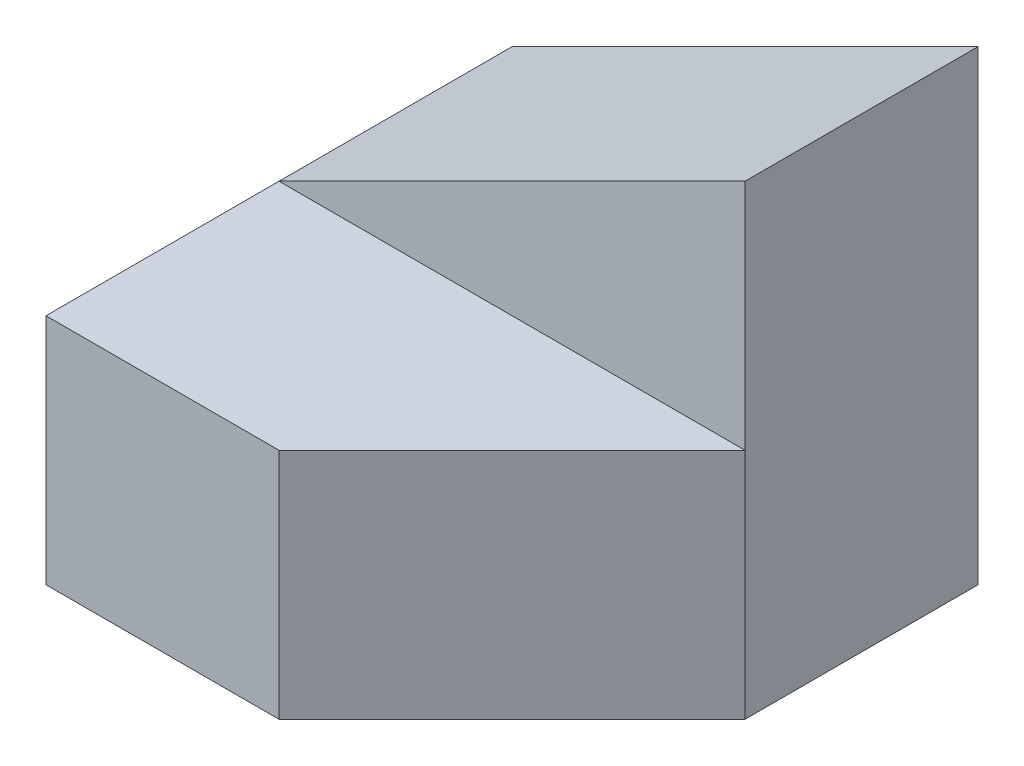
ISO-10303-21;
HEADER;
FILE_DESCRIPTION(('STEP AP214'),'2;1');
FILE_NAME('part.step','',(''),(''),'','','');
FILE_SCHEMA(('AUTOMOTIVE_DESIGN { 1 0 10303 214 1 1 1 1 }'));
ENDSEC;
DATA;
#1=APPLICATION_CONTEXT('core data for automotive mechanical design processes');
#2=APPLICATION_PROTOCOL_DEFINITION('international standard','automotive_design',2000,#1);
#3=PRODUCT_CONTEXT('',#1,'mechanical');
#4=PRODUCT('Part','Part','',(#3));
#5=PRODUCT_RELATED_PRODUCT_CATEGORY('part','',(#4));
#6=PRODUCT_DEFINITION_FORMATION('','',#4);
#7=PRODUCT_DEFINITION_CONTEXT('part definition',#1,'design');
#8=PRODUCT_DEFINITION('design','',#6,#7);
#9=PRODUCT_DEFINITION_SHAPE('','',#8);
#10=(LENGTH_UNIT() NAMED_UNIT(*) SI_UNIT(.MILLI.,.METRE.));
#11=(NAMED_UNIT(*) PLANE_ANGLE_UNIT() SI_UNIT($,.RADIAN.));
#12=(NAMED_UNIT(*) SI_UNIT($,.STERADIAN.) SOLID_ANGLE_UNIT());
#13=UNCERTAINTY_MEASURE_WITH_UNIT(LENGTH_MEASURE(1.E-05),#10,'distance_accuracy_value','');
#14=(GEOMETRIC_REPRESENTATION_CONTEXT(3) GLOBAL_UNCERTAINTY_ASSIGNED_CONTEXT((#13)) GLOBAL_UNIT_ASSIGNED_CONTEXT((#10,
#11,#12)) REPRESENTATION_CONTEXT('',''));
#15=CARTESIAN_POINT('',(0.,0.,0.));
#16=DIRECTION('',(0.,0.,1.));
#17=DIRECTION('',(1.,0.,0.));
#18=AXIS2_PLACEMENT_3D('',#15,#16,#17);
#19=CARTESIAN_POINT('',(0.,0.,40.));
#20=DIRECTION('',(1.,0.,0.));
#21=DIRECTION('',(0.,0.,-1.));
#22=AXIS2_PLACEMENT_3D('',#19,#20,#21);
#23=PLANE('',#22);
#24=DIRECTION('',(0.,-1.,0.));
#25=VECTOR('',#24,1.);
#26=CARTESIAN_POINT('',(0.,0.,40.));
#27=LINE('',#26,#25);
#28=CARTESIAN_POINT('',(0.,20.,40.));
#29=VERTEX_POINT('',#28);
#30=CARTESIAN_POINT('',(0.,0.,40.));
#31=VERTEX_POINT('',#30);
#32=EDGE_CURVE('E56',#29,#31,#27,.T.);
#33=ORIENTED_EDGE('',*,*,#32,.F.);
#34=DIRECTION('',(0.,0.,-1.));
#35=VECTOR('',#34,1.);
#36=CARTESIAN_POINT('',(0.,20.,40.));
#37=LINE('',#36,#35);
#38=CARTESIAN_POINT('',(0.,20.,20.));
#39=VERTEX_POINT('',#38);
#40=EDGE_CURVE('E118',#29,#39,#37,.T.);
#41=ORIENTED_EDGE('',*,*,#40,.T.);
#42=DIRECTION('',(0.,0.,1.));
#43=VECTOR('',#42,1.);
#44=CARTESIAN_POINT('',(0.,20.,0.));
#45=LINE('',#44,#43);
#46=CARTESIAN_POINT('',(0.,20.,0.));
#47=VERTEX_POINT('',#46);
#48=EDGE_CURVE('E109',#47,#39,#45,.T.);
#49=ORIENTED_EDGE('',*,*,#48,.F.);
#50=DIRECTION('',(0.,-1.,0.));
#51=VECTOR('',#50,1.);
#52=CARTESIAN_POINT('',(0.,0.,0.));
#53=LINE('',#52,#51);
#54=CARTESIAN_POINT('',(0.,0.,0.));
#55=VERTEX_POINT('',#54);
#56=EDGE_CURVE('E93',#47,#55,#53,.T.);
#57=ORIENTED_EDGE('',*,*,#56,.T.);
#58=DIRECTION('',(0.,0.,-1.));
#59=VECTOR('',#58,1.);
#60=CARTESIAN_POINT('',(0.,0.,40.));
#61=LINE('',#60,#59);
#62=EDGE_CURVE('E40',#31,#55,#61,.T.);
#63=ORIENTED_EDGE('',*,*,#62,.F.);
#64=EDGE_LOOP('',(#33,#41,#49,#57,#63));
#65=FACE_BOUND('',#64,.T.);
#66=ADVANCED_FACE('F33',(#65),#23,.F.);
#67=CARTESIAN_POINT('',(0.,0.,40.));
#68=DIRECTION('',(0.,1.,0.));
#69=DIRECTION('',(0.,0.,1.));
#70=AXIS2_PLACEMENT_3D('',#67,#68,#69);
#71=PLANE('',#70);
#72=DIRECTION('',(0.,0.,-1.));
#73=VECTOR('',#72,1.);
#74=CARTESIAN_POINT('',(40.,0.,40.));
#75=LINE('',#74,#73);
#76=CARTESIAN_POINT('',(40.,0.,20.));
#77=VERTEX_POINT('',#76);
#78=CARTESIAN_POINT('',(40.,0.,0.));
#79=VERTEX_POINT('',#78);
#80=EDGE_CURVE('E72',#77,#79,#75,.T.);
#81=ORIENTED_EDGE('',*,*,#80,.F.);
#82=DIRECTION('',(-0.707106781186547,0.,0.707106781186548));
#83=VECTOR('',#82,1.);
#84=CARTESIAN_POINT('',(10.,0.,50.));
#85=LINE('',#84,#83);
#86=CARTESIAN_POINT('',(20.,0.,40.));
#87=VERTEX_POINT('',#86);
#88=EDGE_CURVE('E123',#77,#87,#85,.T.);
#89=ORIENTED_EDGE('',*,*,#88,.T.);
#90=DIRECTION('',(1.,0.,0.));
#91=VECTOR('',#90,1.);
#92=CARTESIAN_POINT('',(0.,0.,40.));
#93=LINE('',#92,#91);
#94=EDGE_CURVE('E100',#31,#87,#93,.T.);
#95=ORIENTED_EDGE('',*,*,#94,.F.);
#96=ORIENTED_EDGE('',*,*,#62,.T.);
#97=DIRECTION('',(1.,0.,0.));
#98=VECTOR('',#97,1.);
#99=CARTESIAN_POINT('',(0.,0.,0.));
#100=LINE('',#99,#98);
#101=EDGE_CURVE('E88',#55,#79,#100,.T.);
#102=ORIENTED_EDGE('',*,*,#101,.T.);
#103=EDGE_LOOP('',(#81,#89,#95,#96,#102));
#104=FACE_BOUND('',#103,.T.);
#105=ADVANCED_FACE('F89',(#104),#71,.F.);
#106=CARTESIAN_POINT('',(40.,0.,40.));
#107=DIRECTION('',(-1.,0.,0.));
#108=DIRECTION('',(0.,0.,1.));
#109=AXIS2_PLACEMENT_3D('',#106,#107,#108);
#110=PLANE('',#109);
#111=DIRECTION('',(0.,1.,0.));
#112=VECTOR('',#111,1.);
#113=CARTESIAN_POINT('',(40.,40.,20.));
#114=LINE('',#113,#112);
#115=CARTESIAN_POINT('',(40.,20.,20.));
#116=VERTEX_POINT('',#115);
#117=CARTESIAN_POINT('',(40.,40.,20.));
#118=VERTEX_POINT('',#117);
#119=EDGE_CURVE('E120',#116,#118,#114,.T.);
#120=ORIENTED_EDGE('',*,*,#119,.F.);
#121=DIRECTION('',(0.,1.,0.));
#122=VECTOR('',#121,1.);
#123=CARTESIAN_POINT('',(40.,-20.,20.));
#124=LINE('',#123,#122);
#125=EDGE_CURVE('E81',#77,#116,#124,.T.);
#126=ORIENTED_EDGE('',*,*,#125,.F.);
#127=ORIENTED_EDGE('',*,*,#80,.T.);
#128=DIRECTION('',(0.,1.,0.));
#129=VECTOR('',#128,1.);
#130=CARTESIAN_POINT('',(40.,0.,0.));
#131=LINE('',#130,#129);
#132=CARTESIAN_POINT('',(40.,40.,0.));
#133=VERTEX_POINT('',#132);
#134=EDGE_CURVE('E78',#79,#133,#131,.T.);
#135=ORIENTED_EDGE('',*,*,#134,.T.);
#136=DIRECTION('',(0.,0.,-1.));
#137=VECTOR('',#136,1.);
#138=CARTESIAN_POINT('',(40.,40.,40.));
#139=LINE('',#138,#137);
#140=EDGE_CURVE('E84',#118,#133,#139,.T.);
#141=ORIENTED_EDGE('',*,*,#140,.F.);
#142=EDGE_LOOP('',(#120,#126,#127,#135,#141));
#143=FACE_BOUND('',#142,.T.);
#144=ADVANCED_FACE('F75',(#143),#110,.F.);
#145=CARTESIAN_POINT('',(0.,0.,40.));
#146=DIRECTION('',(0.,0.,-1.));
#147=DIRECTION('',(-1.,0.,0.));
#148=AXIS2_PLACEMENT_3D('',#145,#146,#147);
#149=PLANE('',#148);
#150=ORIENTED_EDGE('',*,*,#94,.T.);
#151=DIRECTION('',(0.,1.,0.));
#152=VECTOR('',#151,1.);
#153=CARTESIAN_POINT('',(20.,-20.,40.));
#154=LINE('',#153,#152);
#155=CARTESIAN_POINT('',(20.,20.,40.));
#156=VERTEX_POINT('',#155);
#157=EDGE_CURVE('E127',#87,#156,#154,.T.);
#158=ORIENTED_EDGE('',*,*,#157,.T.);
#159=DIRECTION('',(1.,0.,0.));
#160=VECTOR('',#159,1.);
#161=CARTESIAN_POINT('',(0.,20.,40.));
#162=LINE('',#161,#160);
#163=EDGE_CURVE('E115',#29,#156,#162,.T.);
#164=ORIENTED_EDGE('',*,*,#163,.F.);
#165=ORIENTED_EDGE('',*,*,#32,.T.);
#166=EDGE_LOOP('',(#150,#158,#164,#165));
#167=FACE_BOUND('',#166,.T.);
#168=ADVANCED_FACE('F139',(#167),#149,.F.);
#169=CARTESIAN_POINT('',(0.,0.,0.));
#170=DIRECTION('',(0.,0.,-1.));
#171=DIRECTION('',(-1.,0.,0.));
#172=AXIS2_PLACEMENT_3D('',#169,#170,#171);
#173=PLANE('',#172);
#174=DIRECTION('',(0.894427190999916,0.447213595499958,0.));
#175=VECTOR('',#174,1.);
#176=CARTESIAN_POINT('',(40.,40.,0.));
#177=LINE('',#176,#175);
#178=EDGE_CURVE('E98',#47,#133,#177,.T.);
#179=ORIENTED_EDGE('',*,*,#178,.T.);
#180=ORIENTED_EDGE('',*,*,#134,.F.);
#181=ORIENTED_EDGE('',*,*,#101,.F.);
#182=ORIENTED_EDGE('',*,*,#56,.F.);
#183=EDGE_LOOP('',(#179,#180,#181,#182));
#184=FACE_BOUND('',#183,.T.);
#185=ADVANCED_FACE('F96',(#184),#173,.T.);
#186=CARTESIAN_POINT('',(40.,40.,0.));
#187=DIRECTION('',(0.447213595499958,-0.894427190999916,0.));
#188=DIRECTION('',(0.894427190999916,0.447213595499958,0.));
#189=AXIS2_PLACEMENT_3D('',#186,#187,#188);
#190=PLANE('',#189);
#191=ORIENTED_EDGE('',*,*,#48,.T.);
#192=DIRECTION('',(0.894427190999916,0.447213595499958,0.));
#193=VECTOR('',#192,1.);
#194=CARTESIAN_POINT('',(40.,40.,20.));
#195=LINE('',#194,#193);
#196=EDGE_CURVE('E11',#39,#118,#195,.T.);
#197=ORIENTED_EDGE('',*,*,#196,.T.);
#198=ORIENTED_EDGE('',*,*,#140,.T.);
#199=ORIENTED_EDGE('',*,*,#178,.F.);
#200=EDGE_LOOP('',(#191,#197,#198,#199));
#201=FACE_BOUND('',#200,.T.);
#202=ADVANCED_FACE('F144',(#201),#190,.F.);
#203=CARTESIAN_POINT('',(0.,40.,20.));
#204=DIRECTION('',(0.,0.,-1.));
#205=DIRECTION('',(0.,1.,0.));
#206=AXIS2_PLACEMENT_3D('',#203,#204,#205);
#207=PLANE('',#206);
#208=DIRECTION('',(1.,0.,0.));
#209=VECTOR('',#208,1.);
#210=CARTESIAN_POINT('',(0.,20.,20.));
#211=LINE('',#210,#209);
#212=EDGE_CURVE('E47',#39,#116,#211,.T.);
#213=ORIENTED_EDGE('',*,*,#212,.T.);
#214=ORIENTED_EDGE('',*,*,#119,.T.);
#215=ORIENTED_EDGE('',*,*,#196,.F.);
#216=EDGE_LOOP('',(#213,#214,#215));
#217=FACE_BOUND('',#216,.T.);
#218=ADVANCED_FACE('F146',(#217),#207,.F.);
#219=CARTESIAN_POINT('',(0.,20.,40.));
#220=DIRECTION('',(0.,-1.,0.));
#221=DIRECTION('',(0.,0.,-1.));
#222=AXIS2_PLACEMENT_3D('',#219,#220,#221);
#223=PLANE('',#222);
#224=ORIENTED_EDGE('',*,*,#163,.T.);
#225=DIRECTION('',(-0.707106781186547,0.,0.707106781186548));
#226=VECTOR('',#225,1.);
#227=CARTESIAN_POINT('',(40.,20.,20.));
#228=LINE('',#227,#226);
#229=EDGE_CURVE('E129',#116,#156,#228,.T.);
#230=ORIENTED_EDGE('',*,*,#229,.F.);
#231=ORIENTED_EDGE('',*,*,#212,.F.);
#232=ORIENTED_EDGE('',*,*,#40,.F.);
#233=EDGE_LOOP('',(#224,#230,#231,#232));
#234=FACE_BOUND('',#233,.T.);
#235=ADVANCED_FACE('F141',(#234),#223,.F.);
#236=CARTESIAN_POINT('',(40.,-20.,20.));
#237=DIRECTION('',(-0.707106781186548,0.,-0.707106781186547));
#238=DIRECTION('',(-0.707106781186547,0.,0.707106781186548));
#239=AXIS2_PLACEMENT_3D('',#236,#237,#238);
#240=PLANE('',#239);
#241=ORIENTED_EDGE('',*,*,#125,.T.);
#242=ORIENTED_EDGE('',*,*,#229,.T.);
#243=ORIENTED_EDGE('',*,*,#157,.F.);
#244=ORIENTED_EDGE('',*,*,#88,.F.);
#245=EDGE_LOOP('',(#241,#242,#243,#244));
#246=FACE_BOUND('',#245,.T.);
#247=ADVANCED_FACE('F135',(#246),#240,.F.);
#248=CLOSED_SHELL('',(#66,#105,#144,#168,#185,#202,#218,#235,#247));
#249=MANIFOLD_SOLID_BREP('B2',#248);
#250=ADVANCED_BREP_SHAPE_REPRESENTATION('',(#18,#249),#14);
#251=SHAPE_DEFINITION_REPRESENTATION(#9,#250);
ENDSEC;
END-ISO-10303-21;
